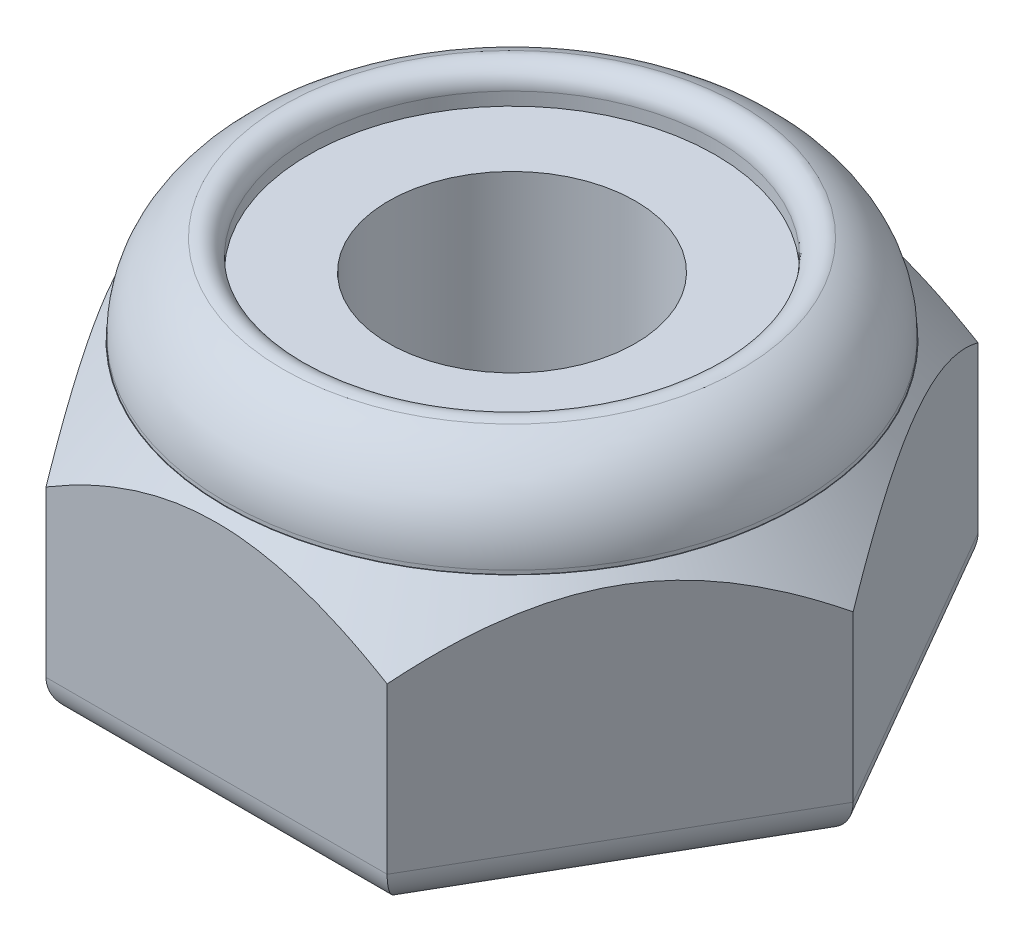
ISO-10303-21;
HEADER;
FILE_DESCRIPTION(('STEP AP214'),'2;1');
FILE_NAME('part.step','',(''),(''),'','','');
FILE_SCHEMA(('AUTOMOTIVE_DESIGN { 1 0 10303 214 1 1 1 1 }'));
ENDSEC;
DATA;
#1=APPLICATION_CONTEXT('core data for automotive mechanical design processes');
#2=APPLICATION_PROTOCOL_DEFINITION('international standard','automotive_design',2000,#1);
#3=PRODUCT_CONTEXT('',#1,'mechanical');
#4=PRODUCT('Part','Part','',(#3));
#5=PRODUCT_RELATED_PRODUCT_CATEGORY('part','',(#4));
#6=PRODUCT_DEFINITION_FORMATION('','',#4);
#7=PRODUCT_DEFINITION_CONTEXT('part definition',#1,'design');
#8=PRODUCT_DEFINITION('design','',#6,#7);
#9=PRODUCT_DEFINITION_SHAPE('','',#8);
#10=(LENGTH_UNIT() NAMED_UNIT(*) SI_UNIT(.MILLI.,.METRE.));
#11=(NAMED_UNIT(*) PLANE_ANGLE_UNIT() SI_UNIT($,.RADIAN.));
#12=(NAMED_UNIT(*) SI_UNIT($,.STERADIAN.) SOLID_ANGLE_UNIT());
#13=UNCERTAINTY_MEASURE_WITH_UNIT(LENGTH_MEASURE(1.E-05),#10,'distance_accuracy_value','');
#14=(GEOMETRIC_REPRESENTATION_CONTEXT(3) GLOBAL_UNCERTAINTY_ASSIGNED_CONTEXT((#13)) GLOBAL_UNIT_ASSIGNED_CONTEXT((#10,
#11,#12)) REPRESENTATION_CONTEXT('',''));
#15=CARTESIAN_POINT('',(0.,0.,0.));
#16=DIRECTION('',(0.,0.,1.));
#17=DIRECTION('',(1.,0.,0.));
#18=AXIS2_PLACEMENT_3D('',#15,#16,#17);
#19=CARTESIAN_POINT('',(0.,4.9784,0.));
#20=DIRECTION('',(0.,-1.,0.));
#21=DIRECTION('',(0.,0.,1.));
#22=AXIS2_PLACEMENT_3D('',#19,#20,#21);
#23=CYLINDRICAL_SURFACE('',#22,3.937);
#24=CARTESIAN_POINT('',(0.,3.7084,0.));
#25=DIRECTION('',(0.,-1.,0.));
#26=DIRECTION('',(0.,0.,-1.));
#27=AXIS2_PLACEMENT_3D('',#24,#25,#26);
#28=CIRCLE('',#27,3.937);
#29=CARTESIAN_POINT('',(0.,3.7084,-3.937));
#30=VERTEX_POINT('',#29);
#31=EDGE_CURVE('E171',#30,#30,#28,.T.);
#32=ORIENTED_EDGE('',*,*,#31,.T.);
#33=EDGE_LOOP('',(#32));
#34=FACE_BOUND('',#33,.T.);
#35=CARTESIAN_POINT('',(0.,3.6576,0.));
#36=DIRECTION('',(0.,1.,0.));
#37=DIRECTION('',(0.,0.,1.));
#38=AXIS2_PLACEMENT_3D('',#35,#36,#37);
#39=CIRCLE('',#38,3.937);
#40=CARTESIAN_POINT('',(0.,3.6576,3.937));
#41=VERTEX_POINT('',#40);
#42=EDGE_CURVE('E40',#41,#41,#39,.F.);
#43=ORIENTED_EDGE('',*,*,#42,.F.);
#44=EDGE_LOOP('',(#43));
#45=FACE_BOUND('',#44,.T.);
#46=ADVANCED_FACE('F37',(#34,#45),#23,.T.);
#47=CARTESIAN_POINT('',(0.,3.7084,0.));
#48=DIRECTION('',(0.,1.,0.));
#49=DIRECTION('',(0.,0.,-1.));
#50=AXIS2_PLACEMENT_3D('',#47,#48,#49);
#51=TOROIDAL_SURFACE('',#50,2.667,1.27);
#52=ORIENTED_EDGE('',*,*,#31,.F.);
#53=EDGE_LOOP('',(#52));
#54=FACE_BOUND('',#53,.T.);
#55=CARTESIAN_POINT('',(0.,4.88572150982644,0.));
#56=DIRECTION('',(0.,1.,0.));
#57=DIRECTION('',(0.,0.,1.));
#58=AXIS2_PLACEMENT_3D('',#55,#56,#57);
#59=CIRCLE('',#58,3.14325);
#60=CARTESIAN_POINT('',(0.,4.88572150982644,3.14325));
#61=VERTEX_POINT('',#60);
#62=EDGE_CURVE('E175',#61,#61,#59,.F.);
#63=ORIENTED_EDGE('',*,*,#62,.T.);
#64=EDGE_LOOP('',(#63));
#65=FACE_BOUND('',#64,.T.);
#66=ADVANCED_FACE('F161',(#54,#65),#51,.T.);
#67=CARTESIAN_POINT('',(2.34315,3.6576,-4.05845484975502));
#68=DIRECTION('',(0.,-1.,0.));
#69=DIRECTION('',(0.,0.,1.));
#70=AXIS2_PLACEMENT_3D('',#67,#68,#69);
#71=PLANE('',#70);
#72=ORIENTED_EDGE('',*,*,#42,.T.);
#73=EDGE_LOOP('',(#72));
#74=FACE_BOUND('',#73,.T.);
#75=CARTESIAN_POINT('',(0.,3.65760000011051,0.));
#76=DIRECTION('',(0.,1.,0.));
#77=DIRECTION('',(0.,0.,1.));
#78=AXIS2_PLACEMENT_3D('',#75,#76,#77);
#79=CIRCLE('',#78,3.94407100938664);
#80=CARTESIAN_POINT('',(0.,3.65760000011051,3.94407100938664));
#81=VERTEX_POINT('',#80);
#82=EDGE_CURVE('E133',#81,#81,#79,.T.);
#83=ORIENTED_EDGE('',*,*,#82,.T.);
#84=EDGE_LOOP('',(#83));
#85=FACE_BOUND('',#84,.T.);
#86=ADVANCED_FACE('F166',(#74,#85),#71,.F.);
#87=CARTESIAN_POINT('',(0.,4.65025720786115,0.));
#88=DIRECTION('',(0.,-1.,0.));
#89=DIRECTION('',(0.,0.,1.));
#90=AXIS2_PLACEMENT_3D('',#87,#88,#89);
#91=TOROIDAL_SURFACE('',#90,3.048,0.254);
#92=CARTESIAN_POINT('',(0.,4.65025720786115,0.));
#93=DIRECTION('',(0.,-1.,0.));
#94=DIRECTION('',(0.,0.,-1.));
#95=AXIS2_PLACEMENT_3D('',#92,#93,#94);
#96=CIRCLE('',#95,2.794);
#97=CARTESIAN_POINT('',(0.,4.65025720786115,-2.794));
#98=VERTEX_POINT('',#97);
#99=EDGE_CURVE('E130',#98,#98,#96,.F.);
#100=ORIENTED_EDGE('',*,*,#99,.F.);
#101=EDGE_LOOP('',(#100));
#102=FACE_BOUND('',#101,.T.);
#103=ORIENTED_EDGE('',*,*,#62,.F.);
#104=EDGE_LOOP('',(#103));
#105=FACE_BOUND('',#104,.T.);
#106=ADVANCED_FACE('F158',(#102,#105),#91,.T.);
#107=CARTESIAN_POINT('',(0.,2.76773860969115,0.));
#108=DIRECTION('',(0.,-1.,0.));
#109=DIRECTION('',(0.,0.,1.));
#110=AXIS2_PLACEMENT_3D('',#107,#108,#109);
#111=CONICAL_SURFACE('',#110,4.69075337389313,0.698131700802158);
#112=CARTESIAN_POINT('',(-4.68630000001476,2.77304593398821,5.3333815551093E-11));
#113=CARTESIAN_POINT('',(-4.65177717141793,2.81418235889091,-0.0597952931149053));
#114=CARTESIAN_POINT('',(-4.61695780288956,2.85432113110728,-0.120104208500933));
#115=CARTESIAN_POINT('',(-4.54666264441453,2.93230661020916,-0.241858994511412));
#116=CARTESIAN_POINT('',(-4.51118655194523,2.97015222462005,-0.303305389120424));
#117=CARTESIAN_POINT('',(-4.40329561885259,3.08018701500149,-0.490177966909938));
#118=CARTESIAN_POINT('',(-4.32983334004397,3.14837015576205,-0.617418366247689));
#119=CARTESIAN_POINT('',(-4.1797796499728,3.27092778609509,-0.877318981315214));
#120=CARTESIAN_POINT('',(-4.10317943932402,3.32525984886677,-1.00999443802899));
#121=CARTESIAN_POINT('',(-3.94747591651278,3.41577217646147,-1.27968085045525));
#122=CARTESIAN_POINT('',(-3.86837998243724,3.45200143013375,-1.4166790269463));
#123=CARTESIAN_POINT('',(-3.73746585196202,3.49372811243502,-1.64342895235813));
#124=CARTESIAN_POINT('',(-3.68614686019516,3.50560413715319,-1.73231605349153));
#125=CARTESIAN_POINT('',(-3.58316406708587,3.52008140702852,-1.91068748346216));
#126=CARTESIAN_POINT('',(-3.53150020834088,3.5226810675312,-2.00017191172355));
#127=CARTESIAN_POINT('',(-3.42855034551142,3.51847006524789,-2.17848630477643));
#128=CARTESIAN_POINT('',(-3.3772638088531,3.51171021118305,-2.26731719201287));
#129=CARTESIAN_POINT('',(-3.27519197708947,3.48921023555424,-2.4441107906491));
#130=CARTESIAN_POINT('',(-3.22440670715057,3.4734696654174,-2.53207345845939));
#131=CARTESIAN_POINT('',(-3.10963060134479,3.42817062222156,-2.73087150520989));
#132=CARTESIAN_POINT('',(-3.04589899577138,3.39598542076133,-2.84125788411098));
#133=CARTESIAN_POINT('',(-2.92018166739655,3.32004827846255,-3.05900668424801));
#134=CARTESIAN_POINT('',(-2.85819691962206,3.27629001415058,-3.16636741668776));
#135=CARTESIAN_POINT('',(-2.735889068299,3.17910361386979,-3.37821082934389));
#136=CARTESIAN_POINT('',(-2.67557364738244,3.12563730731956,-3.48268020285126));
#137=CARTESIAN_POINT('',(-2.55683004320588,3.01104764609313,-3.68835015835892));
#138=CARTESIAN_POINT('',(-2.49840123089761,2.94992687749399,-3.78955182990274));
#139=CARTESIAN_POINT('',(-2.42439626092569,2.86741854625153,-3.91773219790672));
#140=CARTESIAN_POINT('',(-2.40802320106583,2.84883596648691,-3.94609116945937));
#141=CARTESIAN_POINT('',(-2.3754621576302,2.81125673907332,-4.00248855103733));
#142=CARTESIAN_POINT('',(-2.35927376441604,2.79226151161516,-4.03052767057717));
#143=CARTESIAN_POINT('',(-2.3431499999717,2.77304593399368,-4.05845484980404));
#144=B_SPLINE_CURVE_WITH_KNOTS('',3,(#112,#113,#114,#115,#116,#117,#118,#119,#120,#121,#122,
#123,#124,#125,#126,#127,#128,#129,#130,#131,#132,#133,#134,#135,#136,#137,#138,#139,#140,#141,
#142,#143),.UNSPECIFIED.,.F.,.F.,(4,2,2,2,2,2,2,2,2,2,2,2,2,2,2,4),(0.,0.241096809088565,
0.48230758945251,0.967637153847365,1.45443592242802,1.93991010956963,2.24950193433618,
2.5591466432483,2.86711700071403,3.17510274216898,3.56882084711336,3.96275452403261,
4.35827201930639,4.75365624679115,4.86660838982693,4.97921936905084),.UNSPECIFIED.);
#145=CARTESIAN_POINT('',(-4.68630000002839,2.77304593399358,0.));
#146=VERTEX_POINT('',#145);
#147=CARTESIAN_POINT('',(-2.34315000001419,2.77304593399358,-4.05845484977959));
#148=VERTEX_POINT('',#147);
#149=EDGE_CURVE('E114',#146,#148,#144,.T.);
#150=ORIENTED_EDGE('',*,*,#149,.F.);
#151=CARTESIAN_POINT('',(-2.3431499999612,2.77304593398821,4.05845484979447));
#152=CARTESIAN_POINT('',(-2.37767282857321,2.81418235889091,3.99865955663499));
#153=CARTESIAN_POINT('',(-2.41249219710802,2.85432113110728,3.93835064125268));
#154=CARTESIAN_POINT('',(-2.48278735558791,2.93230661020916,3.81659585524501));
#155=CARTESIAN_POINT('',(-2.51826344805563,2.97015222462005,3.75514946063508));
#156=CARTESIAN_POINT('',(-2.62615438114571,3.08018701500149,3.56827688284409));
#157=CARTESIAN_POINT('',(-2.69961665995557,3.14837015576205,3.44103648350706));
#158=CARTESIAN_POINT('',(-2.84967035002766,3.27092778609509,3.18113586844007));
#159=CARTESIAN_POINT('',(-2.9262705606761,3.32525984886676,3.0484604117261));
#160=CARTESIAN_POINT('',(-3.08197408348711,3.41577217646147,2.7787739992997));
#161=CARTESIAN_POINT('',(-3.16107001756274,3.45200143013375,2.6417758228087));
#162=CARTESIAN_POINT('',(-3.291984148038,3.49372811243502,2.4150258973969));
#163=CARTESIAN_POINT('',(-3.34330313980485,3.50560413715318,2.32613879626349));
#164=CARTESIAN_POINT('',(-3.44628593291413,3.52008140702852,2.14776736629286));
#165=CARTESIAN_POINT('',(-3.49794979165912,3.5226810675312,2.05828293803147));
#166=CARTESIAN_POINT('',(-3.60089965448859,3.51847006524788,1.87996854497859));
#167=CARTESIAN_POINT('',(-3.6521861911469,3.51171021118305,1.79113765774214));
#168=CARTESIAN_POINT('',(-3.75425802291053,3.48921023555424,1.61434405910592));
#169=CARTESIAN_POINT('',(-3.80504329284944,3.4734696654174,1.52638139129563));
#170=CARTESIAN_POINT('',(-3.91981939865521,3.42817062222155,1.32758334454512));
#171=CARTESIAN_POINT('',(-3.98355100422863,3.39598542076132,1.21719696564403));
#172=CARTESIAN_POINT('',(-4.10926833260346,3.32004827846254,0.999448165507007));
#173=CARTESIAN_POINT('',(-4.17125308037794,3.27629001415057,0.892087433067258));
#174=CARTESIAN_POINT('',(-4.29356093170101,3.17910361386978,0.680244020411132));
#175=CARTESIAN_POINT('',(-4.35387635261756,3.12563730731955,0.575774646903757));
#176=CARTESIAN_POINT('',(-4.47261995679413,3.01104764609312,0.370104691396094));
#177=CARTESIAN_POINT('',(-4.53104876910239,2.94992687749399,0.268903019852276));
#178=CARTESIAN_POINT('',(-4.60505373907432,2.86741854625152,0.140722651848295));
#179=CARTESIAN_POINT('',(-4.62142679893418,2.84883596648691,0.112363680295645));
#180=CARTESIAN_POINT('',(-4.6539878423698,2.81125673907331,0.0559662987176857));
#181=CARTESIAN_POINT('',(-4.67017623558397,2.79226151161515,0.0279271791778497));
#182=CARTESIAN_POINT('',(-4.68630000002831,2.77304593399367,-4.90190782069009E-11));
#183=B_SPLINE_CURVE_WITH_KNOTS('',3,(#151,#152,#153,#154,#155,#156,#157,#158,#159,#160,#161,
#162,#163,#164,#165,#166,#167,#168,#169,#170,#171,#172,#173,#174,#175,#176,#177,#178,#179,#180,
#181,#182),.UNSPECIFIED.,.F.,.F.,(4,2,2,2,2,2,2,2,2,2,2,2,2,2,2,4),(0.,0.241096809088564,
0.482307589452509,0.967637153847362,1.45443592242802,1.93991010956962,2.24950193433617,
2.5591466432483,2.86711700071402,3.17510274216897,3.56882084711335,3.9627545240326,
4.35827201930639,4.75365624679114,4.86660838982692,4.97921936905084),.UNSPECIFIED.);
#184=CARTESIAN_POINT('',(-2.34315000001419,2.77304593399358,4.0584548497796));
#185=VERTEX_POINT('',#184);
#186=EDGE_CURVE('E238',#185,#146,#183,.T.);
#187=ORIENTED_EDGE('',*,*,#186,.F.);
#188=CARTESIAN_POINT('',(2.34315000005357,2.77304593398821,4.05845484974114));
#189=CARTESIAN_POINT('',(2.27415972170409,2.81414935271335,4.05845484974989));
#190=CARTESIAN_POINT('',(2.20457738522045,2.85425669884704,4.05845484975361));
#191=CARTESIAN_POINT('',(2.06410193528096,2.93218331968193,4.05845484975643));
#192=CARTESIAN_POINT('',(1.99320821641151,2.97000150131419,4.05845484975552));
#193=CARTESIAN_POINT('',(1.77754688772429,3.07999086386454,4.05845484975402));
#194=CARTESIAN_POINT('',(1.63068545869954,3.1481589403704,4.0584548497547));
#195=CARTESIAN_POINT('',(1.33052752457963,3.27077676919261,4.05845484975534));
#196=CARTESIAN_POINT('',(1.17720631609342,3.32516696804195,4.0584548497553));
#197=CARTESIAN_POINT('',(0.865613503807778,3.41574608766058,4.05845484975474));
#198=CARTESIAN_POINT('',(0.707359229311901,3.45199244874898,4.0584548497542));
#199=CARTESIAN_POINT('',(0.456822143345069,3.49192146546895,4.05845484975548));
#200=CARTESIAN_POINT('',(0.365672921156201,3.50290887295604,4.05845484975637));
#201=CARTESIAN_POINT('',(0.183016322004481,3.51758027913677,4.05845484975367));
#202=CARTESIAN_POINT('',(0.0915105175250814,3.5212834103706,4.05845484975008));
#203=CARTESIAN_POINT('',(-0.104649468641441,3.52128177491764,4.0584548497495));
#204=CARTESIAN_POINT('',(-0.209305100872023,3.51643705333648,4.05845484975354));
#205=CARTESIAN_POINT('',(-0.41778718190987,3.49730239560234,4.0584548497565));
#206=CARTESIAN_POINT('',(-0.521613181352877,3.48300765111693,4.05845484975542));
#207=CARTESIAN_POINT('',(-0.728332544913562,3.44553375886281,4.05845484975462));
#208=CARTESIAN_POINT('',(-0.831215331558566,3.42229697724237,4.05845484975491));
#209=CARTESIAN_POINT('',(-1.03487580391125,3.36791830054732,4.05845484975513));
#210=CARTESIAN_POINT('',(-1.13565289468809,3.33677420321767,4.05845484975505));
#211=CARTESIAN_POINT('',(-1.33273383822163,3.26838741918098,4.05845484975499));
#212=CARTESIAN_POINT('',(-1.42908716226035,3.23128582684655,4.05845484975501));
#213=CARTESIAN_POINT('',(-1.61947291708309,3.15151071591982,4.05845484975503));
#214=CARTESIAN_POINT('',(-1.71350470709807,3.10883567899406,4.05845484975502));
#215=CARTESIAN_POINT('',(-1.89803195382395,3.01941532331662,4.05845484975502));
#216=CARTESIAN_POINT('',(-1.98855798046431,2.97273255726059,4.05845484975502));
#217=CARTESIAN_POINT('',(-2.16742834958162,2.87556944084479,4.05845484975502));
#218=CARTESIAN_POINT('',(-2.25577492892455,2.82509321932284,4.05845484975502));
#219=CARTESIAN_POINT('',(-2.34315000005566,2.77304593399424,4.05845484975502));
#220=B_SPLINE_CURVE_WITH_KNOTS('',3,(#188,#189,#190,#191,#192,#193,#194,#195,#196,#197,#198,
#199,#200,#201,#202,#203,#204,#205,#206,#207,#208,#209,#210,#211,#212,#213,#214,#215,#216,#217,
#218,#219),.UNSPECIFIED.,.F.,.F.,(4,2,2,2,2,2,2,2,2,2,2,2,2,2,2,4),(0.,0.24090330355952,
0.481920744736243,0.96705946696845,1.4542606837498,1.93990959177135,2.21507934695766,
2.48952538389391,2.80337599596432,3.11738642360394,3.43345557972405,3.74961286055439,
4.0591611810716,4.36879400620232,4.67425708545866,4.97939238068026),.UNSPECIFIED.);
#221=CARTESIAN_POINT('',(2.34315000001419,2.77304593399358,4.0584548497796));
#222=VERTEX_POINT('',#221);
#223=EDGE_CURVE('E214',#222,#185,#220,.T.);
#224=ORIENTED_EDGE('',*,*,#223,.F.);
#225=CARTESIAN_POINT('',(4.68630000001476,2.77304593398822,-5.33267015141622E-11));
#226=CARTESIAN_POINT('',(4.65177717141792,2.81418235889091,0.0597952931149122));
#227=CARTESIAN_POINT('',(4.61695780288956,2.85432113110729,0.12010420850094));
#228=CARTESIAN_POINT('',(4.54666264441452,2.93230661020917,0.241858994511418));
#229=CARTESIAN_POINT('',(4.51118655194522,2.97015222462005,0.303305389120429));
#230=CARTESIAN_POINT('',(4.40329561885258,3.0801870150015,0.490177966909942));
#231=CARTESIAN_POINT('',(4.32983334004397,3.14837015576206,0.617418366247694));
#232=CARTESIAN_POINT('',(4.1797796499728,3.27092778609509,0.877318981315217));
#233=CARTESIAN_POINT('',(4.10317943932402,3.32525984886677,1.00999443802899));
#234=CARTESIAN_POINT('',(3.94747591651277,3.41577217646148,1.27968085045525));
#235=CARTESIAN_POINT('',(3.86837998243724,3.45200143013375,1.4166790269463));
#236=CARTESIAN_POINT('',(3.73746585196202,3.49372811243502,1.64342895235813));
#237=CARTESIAN_POINT('',(3.68614686019516,3.50560413715319,1.73231605349153));
#238=CARTESIAN_POINT('',(3.58316406708587,3.52008140702852,1.91068748346216));
#239=CARTESIAN_POINT('',(3.53150020834088,3.5226810675312,2.00017191172355));
#240=CARTESIAN_POINT('',(3.42855034551142,3.51847006524789,2.17848630477643));
#241=CARTESIAN_POINT('',(3.3772638088531,3.51171021118306,2.26731719201287));
#242=CARTESIAN_POINT('',(3.27519197708948,3.48921023555424,2.4441107906491));
#243=CARTESIAN_POINT('',(3.22440670715057,3.4734696654174,2.53207345845939));
#244=CARTESIAN_POINT('',(3.10963060134479,3.42817062222156,2.73087150520989));
#245=CARTESIAN_POINT('',(3.04589899577138,3.39598542076133,2.84125788411098));
#246=CARTESIAN_POINT('',(2.92018166739655,3.32004827846255,3.05900668424801));
#247=CARTESIAN_POINT('',(2.85819691962206,3.27629001415058,3.16636741668776));
#248=CARTESIAN_POINT('',(2.735889068299,3.17910361386979,3.37821082934388));
#249=CARTESIAN_POINT('',(2.67557364738245,3.12563730731956,3.48268020285126));
#250=CARTESIAN_POINT('',(2.55683004320588,3.01104764609313,3.68835015835892));
#251=CARTESIAN_POINT('',(2.49840123089762,2.94992687749399,3.78955182990274));
#252=CARTESIAN_POINT('',(2.42439626092569,2.86741854625153,3.91773219790672));
#253=CARTESIAN_POINT('',(2.40802320106583,2.84883596648691,3.94609116945937));
#254=CARTESIAN_POINT('',(2.3754621576302,2.81125673907332,4.00248855103733));
#255=CARTESIAN_POINT('',(2.35927376441604,2.79226151161516,4.03052767057717));
#256=CARTESIAN_POINT('',(2.3431499999717,2.77304593399368,4.05845484980404));
#257=B_SPLINE_CURVE_WITH_KNOTS('',3,(#225,#226,#227,#228,#229,#230,#231,#232,#233,#234,#235,
#236,#237,#238,#239,#240,#241,#242,#243,#244,#245,#246,#247,#248,#249,#250,#251,#252,#253,#254,
#255,#256),.UNSPECIFIED.,.F.,.F.,(4,2,2,2,2,2,2,2,2,2,2,2,2,2,2,4),(0.,0.241096809088564,
0.482307589452508,0.96763715384736,1.45443592242801,1.93991010956962,2.24950193433616,
2.55914664324829,2.86711700071401,3.17510274216896,3.56882084711335,3.96275452403259,
4.35827201930638,4.75365624679113,4.86660838982692,4.97921936905084),.UNSPECIFIED.);
#258=CARTESIAN_POINT('',(4.68630000001419,2.7730459340105,2.45821360759307E-11));
#259=VERTEX_POINT('',#258);
#260=EDGE_CURVE('E129',#259,#222,#257,.T.);
#261=ORIENTED_EDGE('',*,*,#260,.F.);
#262=CARTESIAN_POINT('',(2.3431499999612,2.77304593398822,-4.05845484979446));
#263=CARTESIAN_POINT('',(2.37767282857321,2.81418235889091,-3.99865955663499));
#264=CARTESIAN_POINT('',(2.41249219710801,2.85432113110729,-3.93835064125267));
#265=CARTESIAN_POINT('',(2.48278735558791,2.93230661020917,-3.816595855245));
#266=CARTESIAN_POINT('',(2.51826344805563,2.97015222462005,-3.75514946063508));
#267=CARTESIAN_POINT('',(2.62615438114571,3.08018701500149,-3.56827688284408));
#268=CARTESIAN_POINT('',(2.69961665995557,3.14837015576206,-3.44103648350706));
#269=CARTESIAN_POINT('',(2.84967035002766,3.2709277860951,-3.18113586844006));
#270=CARTESIAN_POINT('',(2.9262705606761,3.32525984886677,-3.04846041172609));
#271=CARTESIAN_POINT('',(3.08197408348711,3.41577217646148,-2.77877399929969));
#272=CARTESIAN_POINT('',(3.16107001756274,3.45200143013376,-2.64177582280869));
#273=CARTESIAN_POINT('',(3.291984148038,3.49372811243503,-2.41502589739689));
#274=CARTESIAN_POINT('',(3.34330313980485,3.50560413715319,-2.32613879626348));
#275=CARTESIAN_POINT('',(3.44628593291413,3.52008140702853,-2.14776736629285));
#276=CARTESIAN_POINT('',(3.49794979165912,3.52268106753121,-2.05828293803146));
#277=CARTESIAN_POINT('',(3.60089965448859,3.51847006524789,-1.87996854497858));
#278=CARTESIAN_POINT('',(3.6521861911469,3.51171021118306,-1.79113765774214));
#279=CARTESIAN_POINT('',(3.75425802291053,3.48921023555425,-1.61434405910591));
#280=CARTESIAN_POINT('',(3.80504329284943,3.47346966541741,-1.52638139129562));
#281=CARTESIAN_POINT('',(3.91981939865521,3.42817062222156,-1.32758334454512));
#282=CARTESIAN_POINT('',(3.98355100422862,3.39598542076133,-1.21719696564403));
#283=CARTESIAN_POINT('',(4.10926833260345,3.32004827846255,-0.999448165506999));
#284=CARTESIAN_POINT('',(4.17125308037794,3.27629001415058,-0.892087433067251));
#285=CARTESIAN_POINT('',(4.293560931701,3.17910361386979,-0.680244020411125));
#286=CARTESIAN_POINT('',(4.35387635261756,3.12563730731956,-0.575774646903749));
#287=CARTESIAN_POINT('',(4.47261995679412,3.01104764609313,-0.370104691396086));
#288=CARTESIAN_POINT('',(4.53104876910239,2.94992687749399,-0.268903019852268));
#289=CARTESIAN_POINT('',(4.60505373907431,2.86741854625153,-0.140722651848287));
#290=CARTESIAN_POINT('',(4.62142679893417,2.84883596648691,-0.112363680295636));
#291=CARTESIAN_POINT('',(4.6539878423698,2.81125673907332,-0.055966298717677));
#292=CARTESIAN_POINT('',(4.67017623558396,2.79226151161516,-0.0279271791778412));
#293=CARTESIAN_POINT('',(4.6863000000283,2.77304593399368,4.90273860582746E-11));
#294=B_SPLINE_CURVE_WITH_KNOTS('',3,(#262,#263,#264,#265,#266,#267,#268,#269,#270,#271,#272,
#273,#274,#275,#276,#277,#278,#279,#280,#281,#282,#283,#284,#285,#286,#287,#288,#289,#290,#291,
#292,#293),.UNSPECIFIED.,.F.,.F.,(4,2,2,2,2,2,2,2,2,2,2,2,2,2,2,4),(0.,0.241096809088565,
0.48230758945251,0.967637153847363,1.45443592242802,1.93991010956962,2.24950193433617,
2.5591466432483,2.86711700071402,3.17510274216897,3.56882084711335,3.9627545240326,
4.35827201930639,4.75365624679114,4.86660838982692,4.97921936905084),.UNSPECIFIED.);
#295=CARTESIAN_POINT('',(2.34315000001419,2.77304593399358,-4.05845484977959));
#296=VERTEX_POINT('',#295);
#297=EDGE_CURVE('E108',#296,#259,#294,.T.);
#298=ORIENTED_EDGE('',*,*,#297,.F.);
#299=CARTESIAN_POINT('',(-2.34315000005357,2.77304593398822,-4.05845484974113));
#300=CARTESIAN_POINT('',(-2.27415972170409,2.81414935271336,-4.05845484974989));
#301=CARTESIAN_POINT('',(-2.20457738522044,2.85425669884705,-4.05845484975361));
#302=CARTESIAN_POINT('',(-2.06410193528096,2.93218331968193,-4.05845484975642));
#303=CARTESIAN_POINT('',(-1.99320821641151,2.9700015013142,-4.05845484975551));
#304=CARTESIAN_POINT('',(-1.77754688772429,3.07999086386455,-4.05845484975401));
#305=CARTESIAN_POINT('',(-1.63068545869954,3.1481589403704,-4.05845484975469));
#306=CARTESIAN_POINT('',(-1.33052752457963,3.27077676919262,-4.05845484975534));
#307=CARTESIAN_POINT('',(-1.17720631609342,3.32516696804196,-4.0584548497553));
#308=CARTESIAN_POINT('',(-0.865613503807779,3.41574608766059,-4.05845484975473));
#309=CARTESIAN_POINT('',(-0.707359229311903,3.45199244874899,-4.0584548497542));
#310=CARTESIAN_POINT('',(-0.456822143345071,3.49192146546895,-4.05845484975548));
#311=CARTESIAN_POINT('',(-0.365672921156202,3.50290887295604,-4.05845484975637));
#312=CARTESIAN_POINT('',(-0.183016322004482,3.51758027913678,-4.05845484975366));
#313=CARTESIAN_POINT('',(-0.0915105175250817,3.52128341037061,-4.05845484975007));
#314=CARTESIAN_POINT('',(0.104649468641441,3.52128177491765,-4.0584548497495));
#315=CARTESIAN_POINT('',(0.209305100872023,3.51643705333648,-4.05845484975354));
#316=CARTESIAN_POINT('',(0.417787181909869,3.49730239560235,-4.05845484975649));
#317=CARTESIAN_POINT('',(0.521613181352877,3.48300765111694,-4.05845484975541));
#318=CARTESIAN_POINT('',(0.728332544913562,3.44553375886282,-4.05845484975462));
#319=CARTESIAN_POINT('',(0.831215331558566,3.42229697724238,-4.05845484975491));
#320=CARTESIAN_POINT('',(1.03487580391125,3.36791830054733,-4.05845484975512));
#321=CARTESIAN_POINT('',(1.13565289468809,3.33677420321768,-4.05845484975504));
#322=CARTESIAN_POINT('',(1.33273383822163,3.26838741918099,-4.05845484975499));
#323=CARTESIAN_POINT('',(1.42908716226035,3.23128582684656,-4.05845484975501));
#324=CARTESIAN_POINT('',(1.61947291708309,3.15151071591982,-4.05845484975502));
#325=CARTESIAN_POINT('',(1.71350470709807,3.10883567899407,-4.05845484975502));
#326=CARTESIAN_POINT('',(1.89803195382395,3.01941532331662,-4.05845484975501));
#327=CARTESIAN_POINT('',(1.98855798046432,2.97273255726059,-4.05845484975502));
#328=CARTESIAN_POINT('',(2.16742834958163,2.87556944084479,-4.05845484975502));
#329=CARTESIAN_POINT('',(2.25577492892455,2.82509321932285,-4.05845484975502));
#330=CARTESIAN_POINT('',(2.34315000005566,2.77304593399424,-4.05845484975502));
#331=B_SPLINE_CURVE_WITH_KNOTS('',3,(#299,#300,#301,#302,#303,#304,#305,#306,#307,#308,#309,
#310,#311,#312,#313,#314,#315,#316,#317,#318,#319,#320,#321,#322,#323,#324,#325,#326,#327,#328,
#329,#330),.UNSPECIFIED.,.F.,.F.,(4,2,2,2,2,2,2,2,2,2,2,2,2,2,2,4),(0.,0.24090330355952,
0.481920744736242,0.967059466968448,1.4542606837498,1.93990959177135,2.21507934695766,
2.4895253838939,2.80337599596431,3.11738642360394,3.43345557972405,3.74961286055439,
4.0591611810716,4.36879400620232,4.67425708545867,4.97939238068026),.UNSPECIFIED.);
#332=EDGE_CURVE('E115',#148,#296,#331,.T.);
#333=ORIENTED_EDGE('',*,*,#332,.F.);
#334=EDGE_LOOP('',(#150,#187,#224,#261,#298,#333));
#335=FACE_BOUND('',#334,.T.);
#336=ORIENTED_EDGE('',*,*,#82,.F.);
#337=EDGE_LOOP('',(#336));
#338=FACE_BOUND('',#337,.T.);
#339=ADVANCED_FACE('F125',(#335,#338),#111,.T.);
#340=CARTESIAN_POINT('',(0.,4.4704,0.));
#341=DIRECTION('',(0.,1.,0.));
#342=DIRECTION('',(0.,0.,-1.));
#343=AXIS2_PLACEMENT_3D('',#340,#341,#342);
#344=CYLINDRICAL_SURFACE('',#343,2.794);
#345=ORIENTED_EDGE('',*,*,#99,.T.);
#346=EDGE_LOOP('',(#345));
#347=FACE_BOUND('',#346,.T.);
#348=CARTESIAN_POINT('',(0.,4.4704,0.));
#349=DIRECTION('',(0.,-1.,0.));
#350=DIRECTION('',(0.,0.,-1.));
#351=AXIS2_PLACEMENT_3D('',#348,#349,#350);
#352=CIRCLE('',#351,2.794);
#353=CARTESIAN_POINT('',(0.,4.4704,-2.794));
#354=VERTEX_POINT('',#353);
#355=EDGE_CURVE('E203',#354,#354,#352,.T.);
#356=ORIENTED_EDGE('',*,*,#355,.T.);
#357=EDGE_LOOP('',(#356));
#358=FACE_BOUND('',#357,.T.);
#359=ADVANCED_FACE('F150',(#347,#358),#344,.F.);
#360=CARTESIAN_POINT('',(2.34315,3.6576,-4.05845484975502));
#361=DIRECTION('',(-0.866025403784439,0.,0.499999999999999));
#362=DIRECTION('',(-0.499999999999999,0.,-0.866025403784439));
#363=AXIS2_PLACEMENT_3D('',#360,#361,#362);
#364=PLANE('',#363);
#365=DIRECTION('',(-0.499999999999999,0.,-0.866025403784439));
#366=VECTOR('',#365,1.);
#367=CARTESIAN_POINT('',(2.34315,0.508,-4.05845484975502));
#368=LINE('',#367,#366);
#369=CARTESIAN_POINT('',(4.6863,0.508,0.));
#370=VERTEX_POINT('',#369);
#371=CARTESIAN_POINT('',(2.34315000000001,0.508,-4.05845484975502));
#372=VERTEX_POINT('',#371);
#373=EDGE_CURVE('E111',#370,#372,#368,.T.);
#374=ORIENTED_EDGE('',*,*,#373,.T.);
#375=DIRECTION('',(0.,1.,0.));
#376=VECTOR('',#375,1.);
#377=CARTESIAN_POINT('',(2.34315000000001,3.6576,-4.05845484975502));
#378=LINE('',#377,#376);
#379=EDGE_CURVE('E103',#296,#372,#378,.F.);
#380=ORIENTED_EDGE('',*,*,#379,.F.);
#381=ORIENTED_EDGE('',*,*,#297,.T.);
#382=DIRECTION('',(0.,1.,0.));
#383=VECTOR('',#382,1.);
#384=CARTESIAN_POINT('',(4.6863,3.6576,0.));
#385=LINE('',#384,#383);
#386=EDGE_CURVE('E206',#370,#259,#385,.T.);
#387=ORIENTED_EDGE('',*,*,#386,.F.);
#388=EDGE_LOOP('',(#374,#380,#381,#387));
#389=FACE_BOUND('',#388,.T.);
#390=ADVANCED_FACE('F105',(#389),#364,.F.);
#391=CARTESIAN_POINT('',(-2.34315,3.6576,-4.05845484975501));
#392=DIRECTION('',(0.,0.,1.));
#393=DIRECTION('',(-1.,0.,0.));
#394=AXIS2_PLACEMENT_3D('',#391,#392,#393);
#395=PLANE('',#394);
#396=DIRECTION('',(-1.,0.,0.));
#397=VECTOR('',#396,1.);
#398=CARTESIAN_POINT('',(-2.34315,0.508,-4.05845484975501));
#399=LINE('',#398,#397);
#400=CARTESIAN_POINT('',(-2.34315,0.508,-4.05845484975501));
#401=VERTEX_POINT('',#400);
#402=EDGE_CURVE('E200',#372,#401,#399,.T.);
#403=ORIENTED_EDGE('',*,*,#402,.T.);
#404=DIRECTION('',(0.,1.,0.));
#405=VECTOR('',#404,1.);
#406=CARTESIAN_POINT('',(-2.34315,3.6576,-4.05845484975501));
#407=LINE('',#406,#405);
#408=EDGE_CURVE('E120',#148,#401,#407,.F.);
#409=ORIENTED_EDGE('',*,*,#408,.F.);
#410=ORIENTED_EDGE('',*,*,#332,.T.);
#411=ORIENTED_EDGE('',*,*,#379,.T.);
#412=EDGE_LOOP('',(#403,#409,#410,#411));
#413=FACE_BOUND('',#412,.T.);
#414=ADVANCED_FACE('F118',(#413),#395,.F.);
#415=CARTESIAN_POINT('',(-4.6863,3.6576,0.));
#416=DIRECTION('',(0.866025403784439,0.,0.5));
#417=DIRECTION('',(-0.5,0.,0.866025403784439));
#418=AXIS2_PLACEMENT_3D('',#415,#416,#417);
#419=PLANE('',#418);
#420=DIRECTION('',(-0.5,0.,0.866025403784439));
#421=VECTOR('',#420,1.);
#422=CARTESIAN_POINT('',(-4.6863,0.508,0.));
#423=LINE('',#422,#421);
#424=CARTESIAN_POINT('',(-4.6863,0.508,0.));
#425=VERTEX_POINT('',#424);
#426=EDGE_CURVE('E197',#401,#425,#423,.T.);
#427=ORIENTED_EDGE('',*,*,#426,.T.);
#428=DIRECTION('',(0.,1.,0.));
#429=VECTOR('',#428,1.);
#430=CARTESIAN_POINT('',(-4.6863,3.6576,0.));
#431=LINE('',#430,#429);
#432=EDGE_CURVE('E243',#146,#425,#431,.F.);
#433=ORIENTED_EDGE('',*,*,#432,.F.);
#434=ORIENTED_EDGE('',*,*,#149,.T.);
#435=ORIENTED_EDGE('',*,*,#408,.T.);
#436=EDGE_LOOP('',(#427,#433,#434,#435));
#437=FACE_BOUND('',#436,.T.);
#438=ADVANCED_FACE('F235',(#437),#419,.F.);
#439=CARTESIAN_POINT('',(-2.34315,3.6576,4.05845484975502));
#440=DIRECTION('',(0.866025403784438,0.,-0.5));
#441=DIRECTION('',(0.5,0.,0.866025403784438));
#442=AXIS2_PLACEMENT_3D('',#439,#440,#441);
#443=PLANE('',#442);
#444=DIRECTION('',(0.5,0.,0.866025403784438));
#445=VECTOR('',#444,1.);
#446=CARTESIAN_POINT('',(-2.34315,0.508,4.05845484975502));
#447=LINE('',#446,#445);
#448=CARTESIAN_POINT('',(-2.34315,0.508,4.05845484975502));
#449=VERTEX_POINT('',#448);
#450=EDGE_CURVE('E194',#425,#449,#447,.T.);
#451=ORIENTED_EDGE('',*,*,#450,.T.);
#452=DIRECTION('',(0.,1.,0.));
#453=VECTOR('',#452,1.);
#454=CARTESIAN_POINT('',(-2.34315,3.6576,4.05845484975502));
#455=LINE('',#454,#453);
#456=EDGE_CURVE('E213',#185,#449,#455,.F.);
#457=ORIENTED_EDGE('',*,*,#456,.F.);
#458=ORIENTED_EDGE('',*,*,#186,.T.);
#459=ORIENTED_EDGE('',*,*,#432,.T.);
#460=EDGE_LOOP('',(#451,#457,#458,#459));
#461=FACE_BOUND('',#460,.T.);
#462=ADVANCED_FACE('F231',(#461),#443,.F.);
#463=CARTESIAN_POINT('',(2.34315,3.6576,4.05845484975502));
#464=DIRECTION('',(0.,0.,-1.));
#465=DIRECTION('',(1.,0.,0.));
#466=AXIS2_PLACEMENT_3D('',#463,#464,#465);
#467=PLANE('',#466);
#468=DIRECTION('',(1.,0.,0.));
#469=VECTOR('',#468,1.);
#470=CARTESIAN_POINT('',(2.34315,0.508,4.05845484975502));
#471=LINE('',#470,#469);
#472=CARTESIAN_POINT('',(2.34315,0.508,4.05845484975502));
#473=VERTEX_POINT('',#472);
#474=EDGE_CURVE('E191',#449,#473,#471,.T.);
#475=ORIENTED_EDGE('',*,*,#474,.T.);
#476=DIRECTION('',(0.,1.,0.));
#477=VECTOR('',#476,1.);
#478=CARTESIAN_POINT('',(2.34315,3.6576,4.05845484975501));
#479=LINE('',#478,#477);
#480=EDGE_CURVE('E212',#222,#473,#479,.F.);
#481=ORIENTED_EDGE('',*,*,#480,.F.);
#482=ORIENTED_EDGE('',*,*,#223,.T.);
#483=ORIENTED_EDGE('',*,*,#456,.T.);
#484=EDGE_LOOP('',(#475,#481,#482,#483));
#485=FACE_BOUND('',#484,.T.);
#486=ADVANCED_FACE('F225',(#485),#467,.F.);
#487=CARTESIAN_POINT('',(4.6863,3.6576,0.));
#488=DIRECTION('',(-0.866025403784439,0.,-0.5));
#489=DIRECTION('',(0.5,0.,-0.866025403784439));
#490=AXIS2_PLACEMENT_3D('',#487,#488,#489);
#491=PLANE('',#490);
#492=DIRECTION('',(0.5,0.,-0.866025403784439));
#493=VECTOR('',#492,1.);
#494=CARTESIAN_POINT('',(4.6863,0.508,0.));
#495=LINE('',#494,#493);
#496=EDGE_CURVE('E188',#473,#370,#495,.T.);
#497=ORIENTED_EDGE('',*,*,#496,.T.);
#498=ORIENTED_EDGE('',*,*,#386,.T.);
#499=ORIENTED_EDGE('',*,*,#260,.T.);
#500=ORIENTED_EDGE('',*,*,#480,.T.);
#501=EDGE_LOOP('',(#497,#498,#499,#500));
#502=FACE_BOUND('',#501,.T.);
#503=ADVANCED_FACE('F220',(#502),#491,.F.);
#504=CARTESIAN_POINT('',(0.,4.4704,0.));
#505=DIRECTION('',(0.,1.,0.));
#506=DIRECTION('',(0.,0.,-1.));
#507=AXIS2_PLACEMENT_3D('',#504,#505,#506);
#508=PLANE('',#507);
#509=CARTESIAN_POINT('',(0.,4.4704,0.));
#510=DIRECTION('',(0.,-1.,0.));
#511=DIRECTION('',(0.,0.,-1.));
#512=AXIS2_PLACEMENT_3D('',#509,#510,#511);
#513=CIRCLE('',#512,1.69545);
#514=CARTESIAN_POINT('',(0.,4.4704,-1.69545));
#515=VERTEX_POINT('',#514);
#516=EDGE_CURVE('E181',#515,#515,#513,.F.);
#517=ORIENTED_EDGE('',*,*,#516,.F.);
#518=EDGE_LOOP('',(#517));
#519=FACE_BOUND('',#518,.T.);
#520=ORIENTED_EDGE('',*,*,#355,.F.);
#521=EDGE_LOOP('',(#520));
#522=FACE_BOUND('',#521,.T.);
#523=ADVANCED_FACE('F224',(#519,#522),#508,.T.);
#524=CARTESIAN_POINT('',(1.9032090948775,0.508,-3.80445484975502));
#525=DIRECTION('',(-0.499999999999999,0.,-0.866025403784439));
#526=DIRECTION('',(0.866025403784439,0.,-0.499999999999999));
#527=AXIS2_PLACEMENT_3D('',#524,#525,#526);
#528=CYLINDRICAL_SURFACE('',#527,0.508);
#529=CARTESIAN_POINT('',(2.04985606325167,0.508,-3.55045484975502));
#530=DIRECTION('',(0.866025403784439,0.,0.5));
#531=DIRECTION('',(-0.5,0.,0.866025403784439));
#532=AXIS2_PLACEMENT_3D('',#529,#530,#531);
#533=ELLIPSE('',#532,0.58658787349666,0.508);
#534=CARTESIAN_POINT('',(2.04985606325167,0.,-3.55045484975502));
#535=VERTEX_POINT('',#534);
#536=EDGE_CURVE('E201',#535,#372,#533,.T.);
#537=ORIENTED_EDGE('',*,*,#536,.T.);
#538=ORIENTED_EDGE('',*,*,#373,.F.);
#539=CARTESIAN_POINT('',(4.09971212650334,0.508,0.));
#540=DIRECTION('',(0.,0.,1.));
#541=DIRECTION('',(1.,0.,0.));
#542=AXIS2_PLACEMENT_3D('',#539,#540,#541);
#543=ELLIPSE('',#542,0.58658787349666,0.508);
#544=CARTESIAN_POINT('',(4.09971212650334,0.,0.));
#545=VERTEX_POINT('',#544);
#546=EDGE_CURVE('E185',#370,#545,#543,.F.);
#547=ORIENTED_EDGE('',*,*,#546,.T.);
#548=DIRECTION('',(-0.499999999999999,0.,-0.866025403784439));
#549=VECTOR('',#548,1.);
#550=CARTESIAN_POINT('',(4.09971212650334,0.,0.));
#551=LINE('',#550,#549);
#552=EDGE_CURVE('E184',#545,#535,#551,.T.);
#553=ORIENTED_EDGE('',*,*,#552,.T.);
#554=EDGE_LOOP('',(#537,#538,#547,#553));
#555=FACE_BOUND('',#554,.T.);
#556=ADVANCED_FACE('F325',(#555),#528,.T.);
#557=CARTESIAN_POINT('',(-2.34315,0.508,-3.55045484975501));
#558=DIRECTION('',(-1.,0.,0.));
#559=DIRECTION('',(0.,0.,-1.));
#560=AXIS2_PLACEMENT_3D('',#557,#558,#559);
#561=CYLINDRICAL_SURFACE('',#560,0.508);
#562=ORIENTED_EDGE('',*,*,#536,.F.);
#563=DIRECTION('',(1.,0.,0.));
#564=VECTOR('',#563,1.);
#565=CARTESIAN_POINT('',(2.34315,0.,-3.55045484975502));
#566=LINE('',#565,#564);
#567=CARTESIAN_POINT('',(-2.04985606325167,0.,-3.55045484975502));
#568=VERTEX_POINT('',#567);
#569=EDGE_CURVE('E422',#535,#568,#566,.F.);
#570=ORIENTED_EDGE('',*,*,#569,.T.);
#571=CARTESIAN_POINT('',(-2.04985606325167,0.508,-3.55045484975501));
#572=DIRECTION('',(0.866025403784439,0.,-0.5));
#573=DIRECTION('',(0.5,0.,0.866025403784439));
#574=AXIS2_PLACEMENT_3D('',#571,#572,#573);
#575=ELLIPSE('',#574,0.58658787349666,0.508);
#576=EDGE_CURVE('E198',#568,#401,#575,.T.);
#577=ORIENTED_EDGE('',*,*,#576,.T.);
#578=ORIENTED_EDGE('',*,*,#402,.F.);
#579=EDGE_LOOP('',(#562,#570,#577,#578));
#580=FACE_BOUND('',#579,.T.);
#581=ADVANCED_FACE('F334',(#580),#561,.T.);
#582=CARTESIAN_POINT('',(-4.24635909487751,0.508,0.254000000000004));
#583=DIRECTION('',(-0.5,0.,0.866025403784439));
#584=DIRECTION('',(-0.866025403784439,0.,-0.5));
#585=AXIS2_PLACEMENT_3D('',#582,#583,#584);
#586=CYLINDRICAL_SURFACE('',#585,0.508);
#587=ORIENTED_EDGE('',*,*,#576,.F.);
#588=DIRECTION('',(-0.5,0.,0.866025403784439));
#589=VECTOR('',#588,1.);
#590=CARTESIAN_POINT('',(-2.04985606325167,0.,-3.55045484975501));
#591=LINE('',#590,#589);
#592=CARTESIAN_POINT('',(-4.09971212650334,0.,0.));
#593=VERTEX_POINT('',#592);
#594=EDGE_CURVE('E420',#568,#593,#591,.T.);
#595=ORIENTED_EDGE('',*,*,#594,.T.);
#596=CARTESIAN_POINT('',(-4.09971212650334,0.508,0.));
#597=DIRECTION('',(0.,0.,-1.));
#598=DIRECTION('',(1.,0.,0.));
#599=AXIS2_PLACEMENT_3D('',#596,#597,#598);
#600=ELLIPSE('',#599,0.58658787349666,0.508);
#601=EDGE_CURVE('E195',#593,#425,#600,.T.);
#602=ORIENTED_EDGE('',*,*,#601,.T.);
#603=ORIENTED_EDGE('',*,*,#426,.F.);
#604=EDGE_LOOP('',(#587,#595,#602,#603));
#605=FACE_BOUND('',#604,.T.);
#606=ADVANCED_FACE('F343',(#605),#586,.T.);
#607=CARTESIAN_POINT('',(-1.90320909487751,0.508,3.80445484975502));
#608=DIRECTION('',(0.5,0.,0.866025403784438));
#609=DIRECTION('',(-0.866025403784438,0.,0.5));
#610=AXIS2_PLACEMENT_3D('',#607,#608,#609);
#611=CYLINDRICAL_SURFACE('',#610,0.508);
#612=ORIENTED_EDGE('',*,*,#601,.F.);
#613=DIRECTION('',(0.5,0.,0.866025403784438));
#614=VECTOR('',#613,1.);
#615=CARTESIAN_POINT('',(-4.09971212650334,0.,0.));
#616=LINE('',#615,#614);
#617=CARTESIAN_POINT('',(-2.04985606325167,0.,3.55045484975502));
#618=VERTEX_POINT('',#617);
#619=EDGE_CURVE('E412',#593,#618,#616,.T.);
#620=ORIENTED_EDGE('',*,*,#619,.T.);
#621=CARTESIAN_POINT('',(-2.04985606325167,0.508,3.55045484975502));
#622=DIRECTION('',(-0.866025403784439,0.,-0.5));
#623=DIRECTION('',(0.5,0.,-0.866025403784439));
#624=AXIS2_PLACEMENT_3D('',#621,#622,#623);
#625=ELLIPSE('',#624,0.58658787349666,0.508);
#626=EDGE_CURVE('E192',#618,#449,#625,.T.);
#627=ORIENTED_EDGE('',*,*,#626,.T.);
#628=ORIENTED_EDGE('',*,*,#450,.F.);
#629=EDGE_LOOP('',(#612,#620,#627,#628));
#630=FACE_BOUND('',#629,.T.);
#631=ADVANCED_FACE('F353',(#630),#611,.T.);
#632=CARTESIAN_POINT('',(2.34315,0.508,3.55045484975502));
#633=DIRECTION('',(1.,0.,0.));
#634=DIRECTION('',(0.,0.,1.));
#635=AXIS2_PLACEMENT_3D('',#632,#633,#634);
#636=CYLINDRICAL_SURFACE('',#635,0.508);
#637=ORIENTED_EDGE('',*,*,#626,.F.);
#638=DIRECTION('',(1.,0.,0.));
#639=VECTOR('',#638,1.);
#640=CARTESIAN_POINT('',(2.34315,0.,3.55045484975502));
#641=LINE('',#640,#639);
#642=CARTESIAN_POINT('',(2.04985606325167,0.,3.55045484975502));
#643=VERTEX_POINT('',#642);
#644=EDGE_CURVE('E409',#618,#643,#641,.T.);
#645=ORIENTED_EDGE('',*,*,#644,.T.);
#646=CARTESIAN_POINT('',(2.04985606325167,0.508,3.55045484975502));
#647=DIRECTION('',(-0.866025403784439,0.,0.5));
#648=DIRECTION('',(-0.5,0.,-0.866025403784439));
#649=AXIS2_PLACEMENT_3D('',#646,#647,#648);
#650=ELLIPSE('',#649,0.58658787349666,0.508);
#651=EDGE_CURVE('E189',#643,#473,#650,.T.);
#652=ORIENTED_EDGE('',*,*,#651,.T.);
#653=ORIENTED_EDGE('',*,*,#474,.F.);
#654=EDGE_LOOP('',(#637,#645,#652,#653));
#655=FACE_BOUND('',#654,.T.);
#656=ADVANCED_FACE('F363',(#655),#636,.T.);
#657=CARTESIAN_POINT('',(4.2463590948775,0.508,-0.253999999999996));
#658=DIRECTION('',(0.5,0.,-0.866025403784439));
#659=DIRECTION('',(0.866025403784439,0.,0.5));
#660=AXIS2_PLACEMENT_3D('',#657,#658,#659);
#661=CYLINDRICAL_SURFACE('',#660,0.508);
#662=ORIENTED_EDGE('',*,*,#546,.F.);
#663=ORIENTED_EDGE('',*,*,#496,.F.);
#664=ORIENTED_EDGE('',*,*,#651,.F.);
#665=DIRECTION('',(0.5,0.,-0.866025403784439));
#666=VECTOR('',#665,1.);
#667=CARTESIAN_POINT('',(2.04985606325167,0.,3.55045484975502));
#668=LINE('',#667,#666);
#669=EDGE_CURVE('E46',#643,#545,#668,.T.);
#670=ORIENTED_EDGE('',*,*,#669,.T.);
#671=EDGE_LOOP('',(#662,#663,#664,#670));
#672=FACE_BOUND('',#671,.T.);
#673=ADVANCED_FACE('F373',(#672),#661,.T.);
#674=CARTESIAN_POINT('',(0.,0.,0.));
#675=DIRECTION('',(0.,1.,0.));
#676=DIRECTION('',(0.,0.,-1.));
#677=AXIS2_PLACEMENT_3D('',#674,#675,#676);
#678=CYLINDRICAL_SURFACE('',#677,1.69545);
#679=ORIENTED_EDGE('',*,*,#516,.T.);
#680=EDGE_LOOP('',(#679));
#681=FACE_BOUND('',#680,.T.);
#682=CARTESIAN_POINT('',(0.,0.,0.));
#683=DIRECTION('',(0.,-1.,0.));
#684=DIRECTION('',(0.,0.,-1.));
#685=AXIS2_PLACEMENT_3D('',#682,#683,#684);
#686=CIRCLE('',#685,1.69545);
#687=CARTESIAN_POINT('',(0.,0.,-1.69545));
#688=VERTEX_POINT('',#687);
#689=EDGE_CURVE('E11',#688,#688,#686,.T.);
#690=ORIENTED_EDGE('',*,*,#689,.T.);
#691=EDGE_LOOP('',(#690));
#692=FACE_BOUND('',#691,.T.);
#693=ADVANCED_FACE('F383',(#681,#692),#678,.F.);
#694=CARTESIAN_POINT('',(2.34315,0.,-4.05845484975502));
#695=DIRECTION('',(0.,-1.,0.));
#696=DIRECTION('',(0.,0.,1.));
#697=AXIS2_PLACEMENT_3D('',#694,#695,#696);
#698=PLANE('',#697);
#699=ORIENTED_EDGE('',*,*,#689,.F.);
#700=EDGE_LOOP('',(#699));
#701=FACE_BOUND('',#700,.T.);
#702=ORIENTED_EDGE('',*,*,#644,.F.);
#703=ORIENTED_EDGE('',*,*,#619,.F.);
#704=ORIENTED_EDGE('',*,*,#594,.F.);
#705=ORIENTED_EDGE('',*,*,#569,.F.);
#706=ORIENTED_EDGE('',*,*,#552,.F.);
#707=ORIENTED_EDGE('',*,*,#669,.F.);
#708=EDGE_LOOP('',(#702,#703,#704,#705,#706,#707));
#709=FACE_BOUND('',#708,.T.);
#710=ADVANCED_FACE('F393',(#701,#709),#698,.T.);
#711=CLOSED_SHELL('',(#46,#66,#86,#106,#339,#359,#390,#414,#438,#462,#486,#503,#523,#556,#581,
#606,#631,#656,#673,#693,#710));
#712=MANIFOLD_SOLID_BREP('B2',#711);
#713=ADVANCED_BREP_SHAPE_REPRESENTATION('',(#18,#712),#14);
#714=SHAPE_DEFINITION_REPRESENTATION(#9,#713);
ENDSEC;
END-ISO-10303-21;
